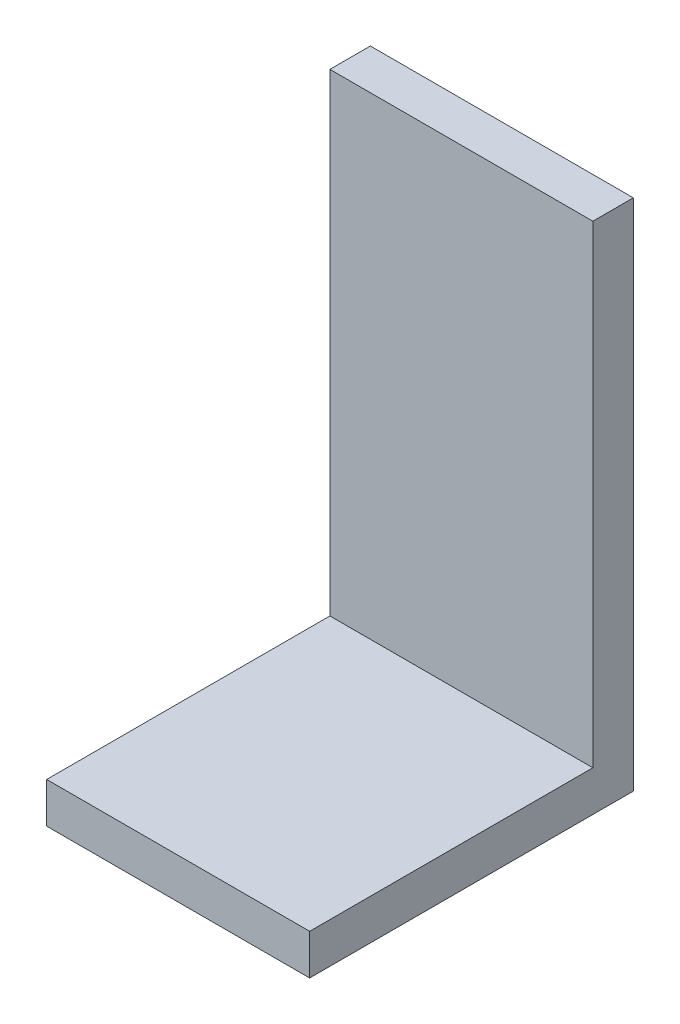
ISO-10303-21;
HEADER;
FILE_DESCRIPTION(('STEP AP214'),'2;1');
FILE_NAME('part.step','',(''),(''),'','','');
FILE_SCHEMA(('AUTOMOTIVE_DESIGN { 1 0 10303 214 1 1 1 1 }'));
ENDSEC;
DATA;
#1=APPLICATION_CONTEXT('core data for automotive mechanical design processes');
#2=APPLICATION_PROTOCOL_DEFINITION('international standard','automotive_design',2000,#1);
#3=PRODUCT_CONTEXT('',#1,'mechanical');
#4=PRODUCT('Part','Part','',(#3));
#5=PRODUCT_RELATED_PRODUCT_CATEGORY('part','',(#4));
#6=PRODUCT_DEFINITION_FORMATION('','',#4);
#7=PRODUCT_DEFINITION_CONTEXT('part definition',#1,'design');
#8=PRODUCT_DEFINITION('design','',#6,#7);
#9=PRODUCT_DEFINITION_SHAPE('','',#8);
#10=(LENGTH_UNIT() NAMED_UNIT(*) SI_UNIT(.MILLI.,.METRE.));
#11=(NAMED_UNIT(*) PLANE_ANGLE_UNIT() SI_UNIT($,.RADIAN.));
#12=(NAMED_UNIT(*) SI_UNIT($,.STERADIAN.) SOLID_ANGLE_UNIT());
#13=UNCERTAINTY_MEASURE_WITH_UNIT(LENGTH_MEASURE(1.E-05),#10,'distance_accuracy_value','');
#14=(GEOMETRIC_REPRESENTATION_CONTEXT(3) GLOBAL_UNCERTAINTY_ASSIGNED_CONTEXT((#13)) GLOBAL_UNIT_ASSIGNED_CONTEXT((#10,
#11,#12)) REPRESENTATION_CONTEXT('',''));
#15=CARTESIAN_POINT('',(0.,0.,0.));
#16=DIRECTION('',(0.,0.,1.));
#17=DIRECTION('',(1.,0.,0.));
#18=AXIS2_PLACEMENT_3D('',#15,#16,#17);
#19=CARTESIAN_POINT('',(-47.6444444444445,2.,-37.6888888888889));
#20=DIRECTION('',(1.,0.,0.));
#21=DIRECTION('',(0.,0.,-1.));
#22=AXIS2_PLACEMENT_3D('',#19,#20,#21);
#23=PLANE('',#22);
#24=DIRECTION('',(0.,0.,1.));
#25=VECTOR('',#24,1.);
#26=CARTESIAN_POINT('',(-47.6444444444445,0.,-37.6888888888889));
#27=LINE('',#26,#25);
#28=CARTESIAN_POINT('',(-47.6444444444445,0.,-37.6888888888889));
#29=VERTEX_POINT('',#28);
#30=CARTESIAN_POINT('',(-47.6444444444445,0.,-21.6888888888889));
#31=VERTEX_POINT('',#30);
#32=EDGE_CURVE('E93',#29,#31,#27,.T.);
#33=ORIENTED_EDGE('',*,*,#32,.T.);
#34=DIRECTION('',(0.,-1.,0.));
#35=VECTOR('',#34,1.);
#36=CARTESIAN_POINT('',(-47.6444444444445,2.,-21.6888888888889));
#37=LINE('',#36,#35);
#38=CARTESIAN_POINT('',(-47.6444444444445,2.,-21.6888888888889));
#39=VERTEX_POINT('',#38);
#40=EDGE_CURVE('E11',#39,#31,#37,.T.);
#41=ORIENTED_EDGE('',*,*,#40,.F.);
#42=DIRECTION('',(0.,0.,1.));
#43=VECTOR('',#42,1.);
#44=CARTESIAN_POINT('',(-47.6444444444445,2.,-37.6888888888889));
#45=LINE('',#44,#43);
#46=CARTESIAN_POINT('',(-47.6444444444445,2.,-35.6888888888889));
#47=VERTEX_POINT('',#46);
#48=EDGE_CURVE('E86',#47,#39,#45,.T.);
#49=ORIENTED_EDGE('',*,*,#48,.F.);
#50=DIRECTION('',(0.,-1.,0.));
#51=VECTOR('',#50,1.);
#52=CARTESIAN_POINT('',(-47.6444444444445,25.4,-35.6888888888889));
#53=LINE('',#52,#51);
#54=CARTESIAN_POINT('',(-47.6444444444445,25.4,-35.6888888888889));
#55=VERTEX_POINT('',#54);
#56=EDGE_CURVE('E101',#55,#47,#53,.T.);
#57=ORIENTED_EDGE('',*,*,#56,.F.);
#58=DIRECTION('',(0.,0.,1.));
#59=VECTOR('',#58,1.);
#60=CARTESIAN_POINT('',(-47.6444444444445,25.4,-37.6888888888889));
#61=LINE('',#60,#59);
#62=CARTESIAN_POINT('',(-47.6444444444445,25.4,-37.6888888888889));
#63=VERTEX_POINT('',#62);
#64=EDGE_CURVE('E96',#63,#55,#61,.T.);
#65=ORIENTED_EDGE('',*,*,#64,.F.);
#66=DIRECTION('',(0.,-1.,0.));
#67=VECTOR('',#66,1.);
#68=CARTESIAN_POINT('',(-47.6444444444445,2.,-37.6888888888889));
#69=LINE('',#68,#67);
#70=EDGE_CURVE('E79',#63,#29,#69,.T.);
#71=ORIENTED_EDGE('',*,*,#70,.T.);
#72=EDGE_LOOP('',(#33,#41,#49,#57,#65,#71));
#73=FACE_BOUND('',#72,.T.);
#74=ADVANCED_FACE('F33',(#73),#23,.F.);
#75=CARTESIAN_POINT('',(-47.6444444444445,2.,-21.6888888888889));
#76=DIRECTION('',(0.,0.,-1.));
#77=DIRECTION('',(-1.,0.,0.));
#78=AXIS2_PLACEMENT_3D('',#75,#76,#77);
#79=PLANE('',#78);
#80=DIRECTION('',(1.,0.,0.));
#81=VECTOR('',#80,1.);
#82=CARTESIAN_POINT('',(-47.6444444444445,0.,-21.6888888888889));
#83=LINE('',#82,#81);
#84=CARTESIAN_POINT('',(-34.6444444444445,0.,-21.6888888888889));
#85=VERTEX_POINT('',#84);
#86=EDGE_CURVE('E100',#31,#85,#83,.T.);
#87=ORIENTED_EDGE('',*,*,#86,.T.);
#88=DIRECTION('',(0.,-1.,0.));
#89=VECTOR('',#88,1.);
#90=CARTESIAN_POINT('',(-34.6444444444445,2.,-21.6888888888889));
#91=LINE('',#90,#89);
#92=CARTESIAN_POINT('',(-34.6444444444445,2.,-21.6888888888889));
#93=VERTEX_POINT('',#92);
#94=EDGE_CURVE('E41',#93,#85,#91,.T.);
#95=ORIENTED_EDGE('',*,*,#94,.F.);
#96=DIRECTION('',(1.,0.,0.));
#97=VECTOR('',#96,1.);
#98=CARTESIAN_POINT('',(-47.6444444444445,2.,-21.6888888888889));
#99=LINE('',#98,#97);
#100=EDGE_CURVE('E55',#39,#93,#99,.T.);
#101=ORIENTED_EDGE('',*,*,#100,.F.);
#102=ORIENTED_EDGE('',*,*,#40,.T.);
#103=EDGE_LOOP('',(#87,#95,#101,#102));
#104=FACE_BOUND('',#103,.T.);
#105=ADVANCED_FACE('F149',(#104),#79,.F.);
#106=CARTESIAN_POINT('',(-34.6444444444445,2.,-37.6888888888889));
#107=DIRECTION('',(-1.,0.,0.));
#108=DIRECTION('',(0.,0.,1.));
#109=AXIS2_PLACEMENT_3D('',#106,#107,#108);
#110=PLANE('',#109);
#111=DIRECTION('',(0.,0.,-1.));
#112=VECTOR('',#111,1.);
#113=CARTESIAN_POINT('',(-34.6444444444445,0.,-37.6888888888889));
#114=LINE('',#113,#112);
#115=CARTESIAN_POINT('',(-34.6444444444445,0.,-37.6888888888889));
#116=VERTEX_POINT('',#115);
#117=EDGE_CURVE('E87',#85,#116,#114,.T.);
#118=ORIENTED_EDGE('',*,*,#117,.T.);
#119=DIRECTION('',(0.,-1.,0.));
#120=VECTOR('',#119,1.);
#121=CARTESIAN_POINT('',(-34.6444444444445,2.,-37.6888888888889));
#122=LINE('',#121,#120);
#123=CARTESIAN_POINT('',(-34.6444444444445,25.4,-37.6888888888889));
#124=VERTEX_POINT('',#123);
#125=EDGE_CURVE('E82',#124,#116,#122,.T.);
#126=ORIENTED_EDGE('',*,*,#125,.F.);
#127=DIRECTION('',(0.,0.,-1.));
#128=VECTOR('',#127,1.);
#129=CARTESIAN_POINT('',(-34.6444444444445,25.4,-37.6888888888889));
#130=LINE('',#129,#128);
#131=CARTESIAN_POINT('',(-34.6444444444445,25.4,-35.6888888888889));
#132=VERTEX_POINT('',#131);
#133=EDGE_CURVE('E135',#132,#124,#130,.T.);
#134=ORIENTED_EDGE('',*,*,#133,.F.);
#135=DIRECTION('',(0.,-1.,0.));
#136=VECTOR('',#135,1.);
#137=CARTESIAN_POINT('',(-34.6444444444445,25.4,-35.6888888888889));
#138=LINE('',#137,#136);
#139=CARTESIAN_POINT('',(-34.6444444444445,2.,-35.6888888888889));
#140=VERTEX_POINT('',#139);
#141=EDGE_CURVE('E105',#132,#140,#138,.T.);
#142=ORIENTED_EDGE('',*,*,#141,.T.);
#143=DIRECTION('',(0.,0.,-1.));
#144=VECTOR('',#143,1.);
#145=CARTESIAN_POINT('',(-34.6444444444445,2.,-37.6888888888889));
#146=LINE('',#145,#144);
#147=EDGE_CURVE('E97',#93,#140,#146,.T.);
#148=ORIENTED_EDGE('',*,*,#147,.F.);
#149=ORIENTED_EDGE('',*,*,#94,.T.);
#150=EDGE_LOOP('',(#118,#126,#134,#142,#148,#149));
#151=FACE_BOUND('',#150,.T.);
#152=ADVANCED_FACE('F133',(#151),#110,.F.);
#153=CARTESIAN_POINT('',(-47.6444444444445,2.,-37.6888888888889));
#154=DIRECTION('',(0.,0.,1.));
#155=DIRECTION('',(1.,0.,0.));
#156=AXIS2_PLACEMENT_3D('',#153,#154,#155);
#157=PLANE('',#156);
#158=DIRECTION('',(-1.,0.,0.));
#159=VECTOR('',#158,1.);
#160=CARTESIAN_POINT('',(-47.6444444444445,0.,-37.6888888888889));
#161=LINE('',#160,#159);
#162=EDGE_CURVE('E75',#116,#29,#161,.T.);
#163=ORIENTED_EDGE('',*,*,#162,.T.);
#164=ORIENTED_EDGE('',*,*,#70,.F.);
#165=DIRECTION('',(-1.,0.,0.));
#166=VECTOR('',#165,1.);
#167=CARTESIAN_POINT('',(-47.6444444444445,25.4,-37.6888888888889));
#168=LINE('',#167,#166);
#169=EDGE_CURVE('E136',#124,#63,#168,.T.);
#170=ORIENTED_EDGE('',*,*,#169,.F.);
#171=ORIENTED_EDGE('',*,*,#125,.T.);
#172=EDGE_LOOP('',(#163,#164,#170,#171));
#173=FACE_BOUND('',#172,.T.);
#174=ADVANCED_FACE('F77',(#173),#157,.F.);
#175=CARTESIAN_POINT('',(0.,2.,0.));
#176=DIRECTION('',(0.,1.,0.));
#177=DIRECTION('',(0.,0.,1.));
#178=AXIS2_PLACEMENT_3D('',#175,#176,#177);
#179=PLANE('',#178);
#180=DIRECTION('',(1.,0.,0.));
#181=VECTOR('',#180,1.);
#182=CARTESIAN_POINT('',(-47.6444444444445,2.,-35.6888888888889));
#183=LINE('',#182,#181);
#184=EDGE_CURVE('E49',#47,#140,#183,.T.);
#185=ORIENTED_EDGE('',*,*,#184,.F.);
#186=ORIENTED_EDGE('',*,*,#48,.T.);
#187=ORIENTED_EDGE('',*,*,#100,.T.);
#188=ORIENTED_EDGE('',*,*,#147,.T.);
#189=EDGE_LOOP('',(#185,#186,#187,#188));
#190=FACE_BOUND('',#189,.T.);
#191=ADVANCED_FACE('F123',(#190),#179,.T.);
#192=CARTESIAN_POINT('',(0.,0.,0.));
#193=DIRECTION('',(0.,1.,0.));
#194=DIRECTION('',(0.,0.,1.));
#195=AXIS2_PLACEMENT_3D('',#192,#193,#194);
#196=PLANE('',#195);
#197=ORIENTED_EDGE('',*,*,#32,.F.);
#198=ORIENTED_EDGE('',*,*,#162,.F.);
#199=ORIENTED_EDGE('',*,*,#117,.F.);
#200=ORIENTED_EDGE('',*,*,#86,.F.);
#201=EDGE_LOOP('',(#197,#198,#199,#200));
#202=FACE_BOUND('',#201,.T.);
#203=ADVANCED_FACE('F99',(#202),#196,.F.);
#204=CARTESIAN_POINT('',(-47.6444444444445,25.4,-35.6888888888889));
#205=DIRECTION('',(0.,0.,-1.));
#206=DIRECTION('',(-1.,0.,0.));
#207=AXIS2_PLACEMENT_3D('',#204,#205,#206);
#208=PLANE('',#207);
#209=ORIENTED_EDGE('',*,*,#184,.T.);
#210=ORIENTED_EDGE('',*,*,#141,.F.);
#211=DIRECTION('',(1.,0.,0.));
#212=VECTOR('',#211,1.);
#213=CARTESIAN_POINT('',(-47.6444444444445,25.4,-35.6888888888889));
#214=LINE('',#213,#212);
#215=EDGE_CURVE('E141',#55,#132,#214,.T.);
#216=ORIENTED_EDGE('',*,*,#215,.F.);
#217=ORIENTED_EDGE('',*,*,#56,.T.);
#218=EDGE_LOOP('',(#209,#210,#216,#217));
#219=FACE_BOUND('',#218,.T.);
#220=ADVANCED_FACE('F129',(#219),#208,.F.);
#221=CARTESIAN_POINT('',(0.,25.4,0.));
#222=DIRECTION('',(0.,1.,0.));
#223=DIRECTION('',(0.,0.,1.));
#224=AXIS2_PLACEMENT_3D('',#221,#222,#223);
#225=PLANE('',#224);
#226=ORIENTED_EDGE('',*,*,#64,.T.);
#227=ORIENTED_EDGE('',*,*,#215,.T.);
#228=ORIENTED_EDGE('',*,*,#133,.T.);
#229=ORIENTED_EDGE('',*,*,#169,.T.);
#230=EDGE_LOOP('',(#226,#227,#228,#229));
#231=FACE_BOUND('',#230,.T.);
#232=ADVANCED_FACE('F146',(#231),#225,.T.);
#233=CLOSED_SHELL('',(#74,#105,#152,#174,#191,#203,#220,#232));
#234=MANIFOLD_SOLID_BREP('B2',#233);
#235=ADVANCED_BREP_SHAPE_REPRESENTATION('',(#18,#234),#14);
#236=SHAPE_DEFINITION_REPRESENTATION(#9,#235);
ENDSEC;
END-ISO-10303-21;
